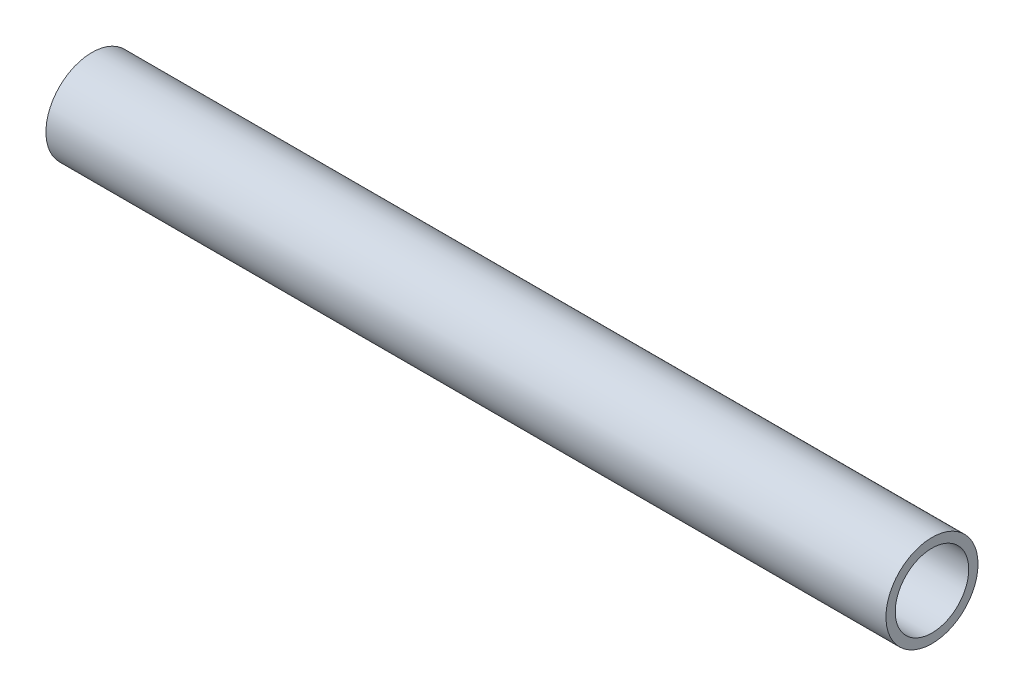
ISO-10303-21;
HEADER;
FILE_DESCRIPTION(('STEP AP214'),'2;1');
FILE_NAME('part.step','',(''),(''),'','','');
FILE_SCHEMA(('AUTOMOTIVE_DESIGN { 1 0 10303 214 1 1 1 1 }'));
ENDSEC;
DATA;
#1=APPLICATION_CONTEXT('core data for automotive mechanical design processes');
#2=APPLICATION_PROTOCOL_DEFINITION('international standard','automotive_design',2000,#1);
#3=PRODUCT_CONTEXT('',#1,'mechanical');
#4=PRODUCT('Part','Part','',(#3));
#5=PRODUCT_RELATED_PRODUCT_CATEGORY('part','',(#4));
#6=PRODUCT_DEFINITION_FORMATION('','',#4);
#7=PRODUCT_DEFINITION_CONTEXT('part definition',#1,'design');
#8=PRODUCT_DEFINITION('design','',#6,#7);
#9=PRODUCT_DEFINITION_SHAPE('','',#8);
#10=(LENGTH_UNIT() NAMED_UNIT(*) SI_UNIT(.MILLI.,.METRE.));
#11=(NAMED_UNIT(*) PLANE_ANGLE_UNIT() SI_UNIT($,.RADIAN.));
#12=(NAMED_UNIT(*) SI_UNIT($,.STERADIAN.) SOLID_ANGLE_UNIT());
#13=UNCERTAINTY_MEASURE_WITH_UNIT(LENGTH_MEASURE(1.E-05),#10,'distance_accuracy_value','');
#14=(GEOMETRIC_REPRESENTATION_CONTEXT(3) GLOBAL_UNCERTAINTY_ASSIGNED_CONTEXT((#13)) GLOBAL_UNIT_ASSIGNED_CONTEXT((#10,
#11,#12)) REPRESENTATION_CONTEXT('',''));
#15=CARTESIAN_POINT('',(0.,0.,0.));
#16=DIRECTION('',(0.,0.,1.));
#17=DIRECTION('',(1.,0.,0.));
#18=AXIS2_PLACEMENT_3D('',#15,#16,#17);
#19=CARTESIAN_POINT('',(304.8,0.,0.));
#20=DIRECTION('',(1.,0.,0.));
#21=DIRECTION('',(0.,0.,-1.));
#22=AXIS2_PLACEMENT_3D('',#19,#20,#21);
#23=PLANE('',#22);
#24=CARTESIAN_POINT('',(304.8,0.,0.));
#25=DIRECTION('',(1.,0.,0.));
#26=DIRECTION('',(0.,0.,-1.));
#27=AXIS2_PLACEMENT_3D('',#24,#25,#26);
#28=CIRCLE('',#27,16.7005);
#29=CARTESIAN_POINT('',(304.8,0.,-16.7005));
#30=VERTEX_POINT('',#29);
#31=EDGE_CURVE('E10',#30,#30,#28,.T.);
#32=ORIENTED_EDGE('',*,*,#31,.T.);
#33=EDGE_LOOP('',(#32));
#34=FACE_BOUND('',#33,.T.);
#35=CARTESIAN_POINT('',(304.8,0.,0.));
#36=DIRECTION('',(1.,0.,0.));
#37=DIRECTION('',(0.,0.,-1.));
#38=AXIS2_PLACEMENT_3D('',#35,#36,#37);
#39=CIRCLE('',#38,13.335);
#40=CARTESIAN_POINT('',(304.8,0.,-13.335));
#41=VERTEX_POINT('',#40);
#42=EDGE_CURVE('E42',#41,#41,#39,.T.);
#43=ORIENTED_EDGE('',*,*,#42,.F.);
#44=EDGE_LOOP('',(#43));
#45=FACE_BOUND('',#44,.T.);
#46=ADVANCED_FACE('F31',(#34,#45),#23,.T.);
#47=CARTESIAN_POINT('',(0.,0.,0.));
#48=DIRECTION('',(1.,0.,0.));
#49=DIRECTION('',(0.,0.,-1.));
#50=AXIS2_PLACEMENT_3D('',#47,#48,#49);
#51=PLANE('',#50);
#52=CARTESIAN_POINT('',(0.,0.,0.));
#53=DIRECTION('',(1.,0.,0.));
#54=DIRECTION('',(0.,0.,-1.));
#55=AXIS2_PLACEMENT_3D('',#52,#53,#54);
#56=CIRCLE('',#55,16.7005);
#57=CARTESIAN_POINT('',(0.,0.,-16.7005));
#58=VERTEX_POINT('',#57);
#59=EDGE_CURVE('E35',#58,#58,#56,.T.);
#60=ORIENTED_EDGE('',*,*,#59,.F.);
#61=EDGE_LOOP('',(#60));
#62=FACE_BOUND('',#61,.T.);
#63=CARTESIAN_POINT('',(0.,0.,0.));
#64=DIRECTION('',(1.,0.,0.));
#65=DIRECTION('',(0.,0.,-1.));
#66=AXIS2_PLACEMENT_3D('',#63,#64,#65);
#67=CIRCLE('',#66,13.335);
#68=CARTESIAN_POINT('',(0.,0.,-13.335));
#69=VERTEX_POINT('',#68);
#70=EDGE_CURVE('E44',#69,#69,#67,.T.);
#71=ORIENTED_EDGE('',*,*,#70,.T.);
#72=EDGE_LOOP('',(#71));
#73=FACE_BOUND('',#72,.T.);
#74=ADVANCED_FACE('F54',(#62,#73),#51,.F.);
#75=CARTESIAN_POINT('',(304.8,0.,0.));
#76=DIRECTION('',(-1.,0.,0.));
#77=DIRECTION('',(0.,0.,1.));
#78=AXIS2_PLACEMENT_3D('',#75,#76,#77);
#79=CYLINDRICAL_SURFACE('',#78,16.7005);
#80=ORIENTED_EDGE('',*,*,#31,.F.);
#81=EDGE_LOOP('',(#80));
#82=FACE_BOUND('',#81,.T.);
#83=ORIENTED_EDGE('',*,*,#59,.T.);
#84=EDGE_LOOP('',(#83));
#85=FACE_BOUND('',#84,.T.);
#86=ADVANCED_FACE('F33',(#82,#85),#79,.T.);
#87=CARTESIAN_POINT('',(304.8,0.,0.));
#88=DIRECTION('',(-1.,0.,0.));
#89=DIRECTION('',(0.,0.,1.));
#90=AXIS2_PLACEMENT_3D('',#87,#88,#89);
#91=CYLINDRICAL_SURFACE('',#90,13.335);
#92=ORIENTED_EDGE('',*,*,#42,.T.);
#93=EDGE_LOOP('',(#92));
#94=FACE_BOUND('',#93,.T.);
#95=ORIENTED_EDGE('',*,*,#70,.F.);
#96=EDGE_LOOP('',(#95));
#97=FACE_BOUND('',#96,.T.);
#98=ADVANCED_FACE('F50',(#94,#97),#91,.F.);
#99=CLOSED_SHELL('',(#46,#74,#86,#98));
#100=MANIFOLD_SOLID_BREP('B2',#99);
#101=ADVANCED_BREP_SHAPE_REPRESENTATION('',(#18,#100),#14);
#102=SHAPE_DEFINITION_REPRESENTATION(#9,#101);
ENDSEC;
END-ISO-10303-21;
